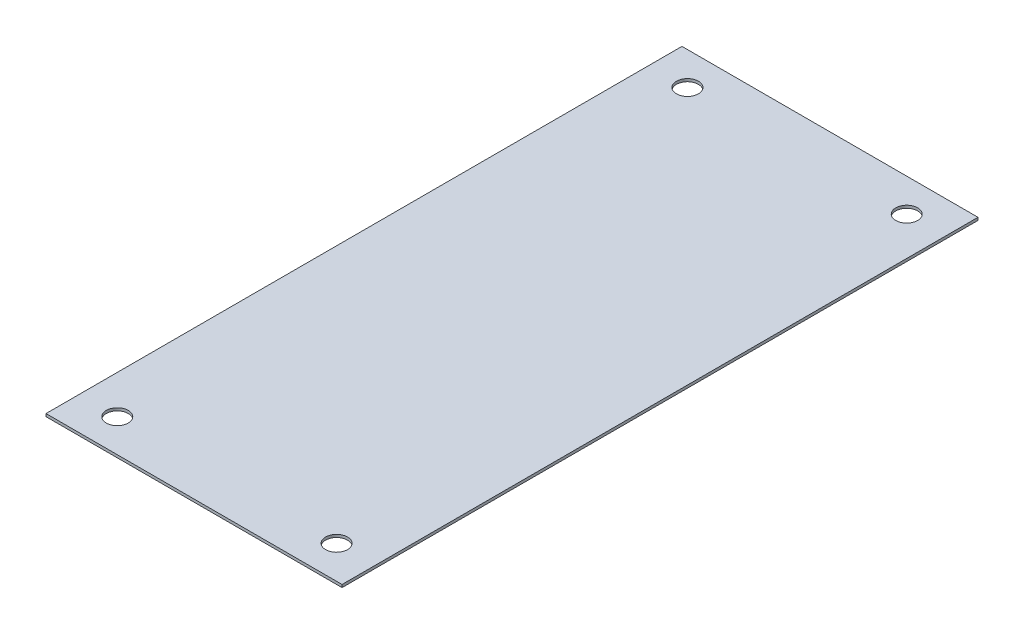
ISO-10303-21;
HEADER;
FILE_DESCRIPTION(('STEP AP214'),'2;1');
FILE_NAME('part.step','',(''),(''),'','','');
FILE_SCHEMA(('AUTOMOTIVE_DESIGN { 1 0 10303 214 1 1 1 1 }'));
ENDSEC;
DATA;
#1=APPLICATION_CONTEXT('core data for automotive mechanical design processes');
#2=APPLICATION_PROTOCOL_DEFINITION('international standard','automotive_design',2000,#1);
#3=PRODUCT_CONTEXT('',#1,'mechanical');
#4=PRODUCT('Part','Part','',(#3));
#5=PRODUCT_RELATED_PRODUCT_CATEGORY('part','',(#4));
#6=PRODUCT_DEFINITION_FORMATION('','',#4);
#7=PRODUCT_DEFINITION_CONTEXT('part definition',#1,'design');
#8=PRODUCT_DEFINITION('design','',#6,#7);
#9=PRODUCT_DEFINITION_SHAPE('','',#8);
#10=(LENGTH_UNIT() NAMED_UNIT(*) SI_UNIT(.MILLI.,.METRE.));
#11=(NAMED_UNIT(*) PLANE_ANGLE_UNIT() SI_UNIT($,.RADIAN.));
#12=(NAMED_UNIT(*) SI_UNIT($,.STERADIAN.) SOLID_ANGLE_UNIT());
#13=UNCERTAINTY_MEASURE_WITH_UNIT(LENGTH_MEASURE(1.E-05),#10,'distance_accuracy_value','');
#14=(GEOMETRIC_REPRESENTATION_CONTEXT(3) GLOBAL_UNCERTAINTY_ASSIGNED_CONTEXT((#13)) GLOBAL_UNIT_ASSIGNED_CONTEXT((#10,
#11,#12)) REPRESENTATION_CONTEXT('',''));
#15=CARTESIAN_POINT('',(0.,0.,0.));
#16=DIRECTION('',(0.,0.,1.));
#17=DIRECTION('',(1.,0.,0.));
#18=AXIS2_PLACEMENT_3D('',#15,#16,#17);
#19=CARTESIAN_POINT('',(0.,3.175,0.));
#20=DIRECTION('',(1.,0.,0.));
#21=DIRECTION('',(0.,0.,-1.));
#22=AXIS2_PLACEMENT_3D('',#19,#20,#21);
#23=PLANE('',#22);
#24=DIRECTION('',(0.,0.,1.));
#25=VECTOR('',#24,1.);
#26=CARTESIAN_POINT('',(0.,0.,0.));
#27=LINE('',#26,#25);
#28=CARTESIAN_POINT('',(0.,0.,-736.6));
#29=VERTEX_POINT('',#28);
#30=CARTESIAN_POINT('',(0.,0.,0.));
#31=VERTEX_POINT('',#30);
#32=EDGE_CURVE('E82',#29,#31,#27,.T.);
#33=ORIENTED_EDGE('',*,*,#32,.T.);
#34=DIRECTION('',(0.,-1.,0.));
#35=VECTOR('',#34,1.);
#36=CARTESIAN_POINT('',(0.,3.175,0.));
#37=LINE('',#36,#35);
#38=CARTESIAN_POINT('',(0.,3.175,0.));
#39=VERTEX_POINT('',#38);
#40=EDGE_CURVE('E11',#39,#31,#37,.T.);
#41=ORIENTED_EDGE('',*,*,#40,.F.);
#42=DIRECTION('',(0.,0.,1.));
#43=VECTOR('',#42,1.);
#44=CARTESIAN_POINT('',(0.,3.175,0.));
#45=LINE('',#44,#43);
#46=CARTESIAN_POINT('',(0.,3.175,-736.6));
#47=VERTEX_POINT('',#46);
#48=EDGE_CURVE('E69',#47,#39,#45,.T.);
#49=ORIENTED_EDGE('',*,*,#48,.F.);
#50=DIRECTION('',(0.,-1.,0.));
#51=VECTOR('',#50,1.);
#52=CARTESIAN_POINT('',(0.,3.175,-736.6));
#53=LINE('',#52,#51);
#54=EDGE_CURVE('E78',#47,#29,#53,.T.);
#55=ORIENTED_EDGE('',*,*,#54,.T.);
#56=EDGE_LOOP('',(#33,#41,#49,#55));
#57=FACE_BOUND('',#56,.T.);
#58=ADVANCED_FACE('F17',(#57),#23,.F.);
#59=CARTESIAN_POINT('',(0.,3.175,0.));
#60=DIRECTION('',(0.,0.,-1.));
#61=DIRECTION('',(-1.,0.,0.));
#62=AXIS2_PLACEMENT_3D('',#59,#60,#61);
#63=PLANE('',#62);
#64=DIRECTION('',(1.,0.,0.));
#65=VECTOR('',#64,1.);
#66=CARTESIAN_POINT('',(0.,0.,0.));
#67=LINE('',#66,#65);
#68=CARTESIAN_POINT('',(342.9,0.,0.));
#69=VERTEX_POINT('',#68);
#70=EDGE_CURVE('E73',#31,#69,#67,.T.);
#71=ORIENTED_EDGE('',*,*,#70,.T.);
#72=DIRECTION('',(0.,-1.,0.));
#73=VECTOR('',#72,1.);
#74=CARTESIAN_POINT('',(342.9,3.175,0.));
#75=LINE('',#74,#73);
#76=CARTESIAN_POINT('',(342.9,3.175,0.));
#77=VERTEX_POINT('',#76);
#78=EDGE_CURVE('E26',#77,#69,#75,.T.);
#79=ORIENTED_EDGE('',*,*,#78,.F.);
#80=DIRECTION('',(1.,0.,0.));
#81=VECTOR('',#80,1.);
#82=CARTESIAN_POINT('',(0.,3.175,0.));
#83=LINE('',#82,#81);
#84=EDGE_CURVE('E64',#39,#77,#83,.T.);
#85=ORIENTED_EDGE('',*,*,#84,.F.);
#86=ORIENTED_EDGE('',*,*,#40,.T.);
#87=EDGE_LOOP('',(#71,#79,#85,#86));
#88=FACE_BOUND('',#87,.T.);
#89=ADVANCED_FACE('F72',(#88),#63,.F.);
#90=CARTESIAN_POINT('',(342.9,3.175,0.));
#91=DIRECTION('',(-1.,0.,0.));
#92=DIRECTION('',(0.,0.,1.));
#93=AXIS2_PLACEMENT_3D('',#90,#91,#92);
#94=PLANE('',#93);
#95=DIRECTION('',(0.,0.,-1.));
#96=VECTOR('',#95,1.);
#97=CARTESIAN_POINT('',(342.9,0.,0.));
#98=LINE('',#97,#96);
#99=CARTESIAN_POINT('',(342.9,0.,-736.6));
#100=VERTEX_POINT('',#99);
#101=EDGE_CURVE('E51',#69,#100,#98,.T.);
#102=ORIENTED_EDGE('',*,*,#101,.T.);
#103=DIRECTION('',(0.,-1.,0.));
#104=VECTOR('',#103,1.);
#105=CARTESIAN_POINT('',(342.9,3.175,-736.6));
#106=LINE('',#105,#104);
#107=CARTESIAN_POINT('',(342.9,3.175,-736.6));
#108=VERTEX_POINT('',#107);
#109=EDGE_CURVE('E74',#108,#100,#106,.T.);
#110=ORIENTED_EDGE('',*,*,#109,.F.);
#111=DIRECTION('',(0.,0.,-1.));
#112=VECTOR('',#111,1.);
#113=CARTESIAN_POINT('',(342.9,3.175,0.));
#114=LINE('',#113,#112);
#115=EDGE_CURVE('E67',#77,#108,#114,.T.);
#116=ORIENTED_EDGE('',*,*,#115,.F.);
#117=ORIENTED_EDGE('',*,*,#78,.T.);
#118=EDGE_LOOP('',(#102,#110,#116,#117));
#119=FACE_BOUND('',#118,.T.);
#120=ADVANCED_FACE('F76',(#119),#94,.F.);
#121=CARTESIAN_POINT('',(0.,3.175,-736.6));
#122=DIRECTION('',(0.,0.,1.));
#123=DIRECTION('',(1.,0.,0.));
#124=AXIS2_PLACEMENT_3D('',#121,#122,#123);
#125=PLANE('',#124);
#126=DIRECTION('',(-1.,0.,0.));
#127=VECTOR('',#126,1.);
#128=CARTESIAN_POINT('',(0.,0.,-736.6));
#129=LINE('',#128,#127);
#130=EDGE_CURVE('E57',#100,#29,#129,.T.);
#131=ORIENTED_EDGE('',*,*,#130,.T.);
#132=ORIENTED_EDGE('',*,*,#54,.F.);
#133=DIRECTION('',(-1.,0.,0.));
#134=VECTOR('',#133,1.);
#135=CARTESIAN_POINT('',(0.,3.175,-736.6));
#136=LINE('',#135,#134);
#137=EDGE_CURVE('E34',#108,#47,#136,.T.);
#138=ORIENTED_EDGE('',*,*,#137,.F.);
#139=ORIENTED_EDGE('',*,*,#109,.T.);
#140=EDGE_LOOP('',(#131,#132,#138,#139));
#141=FACE_BOUND('',#140,.T.);
#142=ADVANCED_FACE('F89',(#141),#125,.F.);
#143=CARTESIAN_POINT('',(0.,3.175,-736.6));
#144=DIRECTION('',(0.,-1.,0.));
#145=DIRECTION('',(0.,0.,-1.));
#146=AXIS2_PLACEMENT_3D('',#143,#144,#145);
#147=PLANE('',#146);
#148=CARTESIAN_POINT('',(44.45,3.175,-38.1));
#149=DIRECTION('',(0.,1.,0.));
#150=DIRECTION('',(0.,0.,1.));
#151=AXIS2_PLACEMENT_3D('',#148,#149,#150);
#152=CIRCLE('',#151,12.7);
#153=CARTESIAN_POINT('',(44.45,3.175,-25.4));
#154=VERTEX_POINT('',#153);
#155=EDGE_CURVE('E113',#154,#154,#152,.T.);
#156=ORIENTED_EDGE('',*,*,#155,.F.);
#157=EDGE_LOOP('',(#156));
#158=FACE_BOUND('',#157,.T.);
#159=CARTESIAN_POINT('',(44.45,3.175,-698.5));
#160=DIRECTION('',(0.,1.,0.));
#161=DIRECTION('',(0.,0.,1.));
#162=AXIS2_PLACEMENT_3D('',#159,#160,#161);
#163=CIRCLE('',#162,12.7);
#164=CARTESIAN_POINT('',(44.45,3.175,-685.8));
#165=VERTEX_POINT('',#164);
#166=EDGE_CURVE('E107',#165,#165,#163,.T.);
#167=ORIENTED_EDGE('',*,*,#166,.F.);
#168=EDGE_LOOP('',(#167));
#169=FACE_BOUND('',#168,.T.);
#170=CARTESIAN_POINT('',(298.45,3.175,-698.5));
#171=DIRECTION('',(0.,1.,0.));
#172=DIRECTION('',(0.,0.,1.));
#173=AXIS2_PLACEMENT_3D('',#170,#171,#172);
#174=CIRCLE('',#173,12.7);
#175=CARTESIAN_POINT('',(298.45,3.175,-685.8));
#176=VERTEX_POINT('',#175);
#177=EDGE_CURVE('E101',#176,#176,#174,.T.);
#178=ORIENTED_EDGE('',*,*,#177,.F.);
#179=EDGE_LOOP('',(#178));
#180=FACE_BOUND('',#179,.T.);
#181=CARTESIAN_POINT('',(298.45,3.175,-38.1));
#182=DIRECTION('',(0.,1.,0.));
#183=DIRECTION('',(0.,0.,1.));
#184=AXIS2_PLACEMENT_3D('',#181,#182,#183);
#185=CIRCLE('',#184,12.7);
#186=CARTESIAN_POINT('',(298.45,3.175,-25.4));
#187=VERTEX_POINT('',#186);
#188=EDGE_CURVE('E95',#187,#187,#185,.T.);
#189=ORIENTED_EDGE('',*,*,#188,.F.);
#190=EDGE_LOOP('',(#189));
#191=FACE_BOUND('',#190,.T.);
#192=ORIENTED_EDGE('',*,*,#48,.T.);
#193=ORIENTED_EDGE('',*,*,#84,.T.);
#194=ORIENTED_EDGE('',*,*,#115,.T.);
#195=ORIENTED_EDGE('',*,*,#137,.T.);
#196=EDGE_LOOP('',(#192,#193,#194,#195));
#197=FACE_BOUND('',#196,.T.);
#198=ADVANCED_FACE('F65',(#158,#169,#180,#191,#197),#147,.F.);
#199=CARTESIAN_POINT('',(0.,0.,-736.6));
#200=DIRECTION('',(0.,-1.,0.));
#201=DIRECTION('',(0.,0.,-1.));
#202=AXIS2_PLACEMENT_3D('',#199,#200,#201);
#203=PLANE('',#202);
#204=CARTESIAN_POINT('',(44.45,0.,-38.1));
#205=DIRECTION('',(0.,-1.,0.));
#206=DIRECTION('',(0.,0.,-1.));
#207=AXIS2_PLACEMENT_3D('',#204,#205,#206);
#208=CIRCLE('',#207,12.7);
#209=CARTESIAN_POINT('',(44.45,0.,-50.8));
#210=VERTEX_POINT('',#209);
#211=EDGE_CURVE('E110',#210,#210,#208,.T.);
#212=ORIENTED_EDGE('',*,*,#211,.F.);
#213=EDGE_LOOP('',(#212));
#214=FACE_BOUND('',#213,.T.);
#215=CARTESIAN_POINT('',(44.45,0.,-698.5));
#216=DIRECTION('',(0.,-1.,0.));
#217=DIRECTION('',(0.,0.,-1.));
#218=AXIS2_PLACEMENT_3D('',#215,#216,#217);
#219=CIRCLE('',#218,12.7);
#220=CARTESIAN_POINT('',(44.45,0.,-711.2));
#221=VERTEX_POINT('',#220);
#222=EDGE_CURVE('E104',#221,#221,#219,.T.);
#223=ORIENTED_EDGE('',*,*,#222,.F.);
#224=EDGE_LOOP('',(#223));
#225=FACE_BOUND('',#224,.T.);
#226=CARTESIAN_POINT('',(298.45,0.,-698.5));
#227=DIRECTION('',(0.,-1.,0.));
#228=DIRECTION('',(0.,0.,-1.));
#229=AXIS2_PLACEMENT_3D('',#226,#227,#228);
#230=CIRCLE('',#229,12.7);
#231=CARTESIAN_POINT('',(298.45,0.,-711.2));
#232=VERTEX_POINT('',#231);
#233=EDGE_CURVE('E98',#232,#232,#230,.T.);
#234=ORIENTED_EDGE('',*,*,#233,.F.);
#235=EDGE_LOOP('',(#234));
#236=FACE_BOUND('',#235,.T.);
#237=CARTESIAN_POINT('',(298.45,0.,-38.1));
#238=DIRECTION('',(0.,-1.,0.));
#239=DIRECTION('',(0.,0.,-1.));
#240=AXIS2_PLACEMENT_3D('',#237,#238,#239);
#241=CIRCLE('',#240,12.7);
#242=CARTESIAN_POINT('',(298.45,0.,-50.8));
#243=VERTEX_POINT('',#242);
#244=EDGE_CURVE('E20',#243,#243,#241,.T.);
#245=ORIENTED_EDGE('',*,*,#244,.F.);
#246=EDGE_LOOP('',(#245));
#247=FACE_BOUND('',#246,.T.);
#248=ORIENTED_EDGE('',*,*,#32,.F.);
#249=ORIENTED_EDGE('',*,*,#130,.F.);
#250=ORIENTED_EDGE('',*,*,#101,.F.);
#251=ORIENTED_EDGE('',*,*,#70,.F.);
#252=EDGE_LOOP('',(#248,#249,#250,#251));
#253=FACE_BOUND('',#252,.T.);
#254=ADVANCED_FACE('F92',(#214,#225,#236,#247,#253),#203,.T.);
#255=CARTESIAN_POINT('',(298.45,3.175,-38.1));
#256=DIRECTION('',(0.,1.,0.));
#257=DIRECTION('',(0.,0.,1.));
#258=AXIS2_PLACEMENT_3D('',#255,#256,#257);
#259=CYLINDRICAL_SURFACE('',#258,12.7);
#260=ORIENTED_EDGE('',*,*,#244,.T.);
#261=EDGE_LOOP('',(#260));
#262=FACE_BOUND('',#261,.T.);
#263=ORIENTED_EDGE('',*,*,#188,.T.);
#264=EDGE_LOOP('',(#263));
#265=FACE_BOUND('',#264,.T.);
#266=ADVANCED_FACE('F128',(#262,#265),#259,.F.);
#267=CARTESIAN_POINT('',(298.45,3.175,-698.5));
#268=DIRECTION('',(0.,1.,0.));
#269=DIRECTION('',(0.,0.,1.));
#270=AXIS2_PLACEMENT_3D('',#267,#268,#269);
#271=CYLINDRICAL_SURFACE('',#270,12.7);
#272=ORIENTED_EDGE('',*,*,#233,.T.);
#273=EDGE_LOOP('',(#272));
#274=FACE_BOUND('',#273,.T.);
#275=ORIENTED_EDGE('',*,*,#177,.T.);
#276=EDGE_LOOP('',(#275));
#277=FACE_BOUND('',#276,.T.);
#278=ADVANCED_FACE('F130',(#274,#277),#271,.F.);
#279=CARTESIAN_POINT('',(44.45,3.175,-698.5));
#280=DIRECTION('',(0.,1.,0.));
#281=DIRECTION('',(0.,0.,1.));
#282=AXIS2_PLACEMENT_3D('',#279,#280,#281);
#283=CYLINDRICAL_SURFACE('',#282,12.7);
#284=ORIENTED_EDGE('',*,*,#222,.T.);
#285=EDGE_LOOP('',(#284));
#286=FACE_BOUND('',#285,.T.);
#287=ORIENTED_EDGE('',*,*,#166,.T.);
#288=EDGE_LOOP('',(#287));
#289=FACE_BOUND('',#288,.T.);
#290=ADVANCED_FACE('F139',(#286,#289),#283,.F.);
#291=CARTESIAN_POINT('',(44.45,3.175,-38.1));
#292=DIRECTION('',(0.,1.,0.));
#293=DIRECTION('',(0.,0.,1.));
#294=AXIS2_PLACEMENT_3D('',#291,#292,#293);
#295=CYLINDRICAL_SURFACE('',#294,12.7);
#296=ORIENTED_EDGE('',*,*,#211,.T.);
#297=EDGE_LOOP('',(#296));
#298=FACE_BOUND('',#297,.T.);
#299=ORIENTED_EDGE('',*,*,#155,.T.);
#300=EDGE_LOOP('',(#299));
#301=FACE_BOUND('',#300,.T.);
#302=ADVANCED_FACE('F117',(#298,#301),#295,.F.);
#303=CLOSED_SHELL('',(#58,#89,#120,#142,#198,#254,#266,#278,#290,#302));
#304=MANIFOLD_SOLID_BREP('B1',#303);
#305=ADVANCED_BREP_SHAPE_REPRESENTATION('',(#18,#304),#14);
#306=SHAPE_DEFINITION_REPRESENTATION(#9,#305);
ENDSEC;
END-ISO-10303-21;
